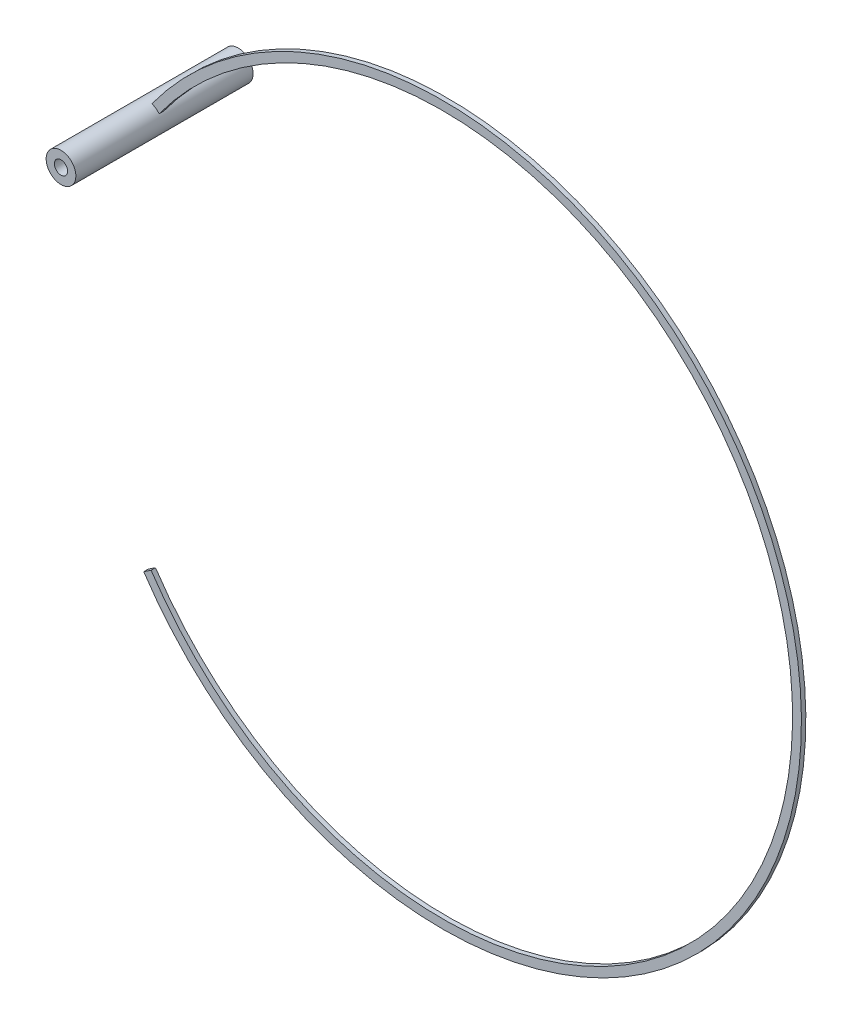
ISO-10303-21;
HEADER;
FILE_DESCRIPTION(('STEP AP214'),'2;1');
FILE_NAME('part.step','',(''),(''),'','','');
FILE_SCHEMA(('AUTOMOTIVE_DESIGN { 1 0 10303 214 1 1 1 1 }'));
ENDSEC;
DATA;
#1=APPLICATION_CONTEXT('core data for automotive mechanical design processes');
#2=APPLICATION_PROTOCOL_DEFINITION('international standard','automotive_design',2000,#1);
#3=PRODUCT_CONTEXT('',#1,'mechanical');
#4=PRODUCT('Part','Part','',(#3));
#5=PRODUCT_RELATED_PRODUCT_CATEGORY('part','',(#4));
#6=PRODUCT_DEFINITION_FORMATION('','',#4);
#7=PRODUCT_DEFINITION_CONTEXT('part definition',#1,'design');
#8=PRODUCT_DEFINITION('design','',#6,#7);
#9=PRODUCT_DEFINITION_SHAPE('','',#8);
#10=(LENGTH_UNIT() NAMED_UNIT(*) SI_UNIT(.MILLI.,.METRE.));
#11=(NAMED_UNIT(*) PLANE_ANGLE_UNIT() SI_UNIT($,.RADIAN.));
#12=(NAMED_UNIT(*) SI_UNIT($,.STERADIAN.) SOLID_ANGLE_UNIT());
#13=UNCERTAINTY_MEASURE_WITH_UNIT(LENGTH_MEASURE(1.E-05),#10,'distance_accuracy_value','');
#14=(GEOMETRIC_REPRESENTATION_CONTEXT(3) GLOBAL_UNCERTAINTY_ASSIGNED_CONTEXT((#13)) GLOBAL_UNIT_ASSIGNED_CONTEXT((#10,
#11,#12)) REPRESENTATION_CONTEXT('',''));
#15=CARTESIAN_POINT('',(0.,0.,0.));
#16=DIRECTION('',(0.,0.,1.));
#17=DIRECTION('',(1.,0.,0.));
#18=AXIS2_PLACEMENT_3D('',#15,#16,#17);
#19=CARTESIAN_POINT('',(-12.4954171005917,27.3397937105227,10.));
#20=DIRECTION('',(0.,0.,-1.));
#21=DIRECTION('',(-1.,0.,0.));
#22=AXIS2_PLACEMENT_3D('',#19,#20,#21);
#23=CYLINDRICAL_SURFACE('',#22,1.67526348251068);
#24=CARTESIAN_POINT('',(-12.4954171005917,27.3397937105227,-10.));
#25=DIRECTION('',(0.,0.,1.));
#26=DIRECTION('',(1.,0.,0.));
#27=AXIS2_PLACEMENT_3D('',#24,#25,#26);
#28=CIRCLE('',#27,1.67526348251068);
#29=CARTESIAN_POINT('',(-10.8201536180811,27.3397937105227,-10.));
#30=VERTEX_POINT('',#29);
#31=EDGE_CURVE('E159',#30,#30,#28,.T.);
#32=ORIENTED_EDGE('',*,*,#31,.T.);
#33=EDGE_LOOP('',(#32));
#34=FACE_BOUND('',#33,.T.);
#35=CARTESIAN_POINT('',(-12.4954171005917,27.3397937105227,10.));
#36=DIRECTION('',(0.,0.,1.));
#37=DIRECTION('',(1.,0.,0.));
#38=AXIS2_PLACEMENT_3D('',#35,#36,#37);
#39=CIRCLE('',#38,1.67526348251068);
#40=CARTESIAN_POINT('',(-10.8201536180811,27.3397937105227,10.));
#41=VERTEX_POINT('',#40);
#42=EDGE_CURVE('E162',#41,#41,#39,.T.);
#43=ORIENTED_EDGE('',*,*,#42,.F.);
#44=EDGE_LOOP('',(#43));
#45=FACE_BOUND('',#44,.T.);
#46=CARTESIAN_POINT('',(-12.4954171005917,27.3397937105227,0.248562421087051));
#47=DIRECTION('',(0.,0.,-1.));
#48=DIRECTION('',(-1.,0.,0.));
#49=AXIS2_PLACEMENT_3D('',#46,#47,#48);
#50=CIRCLE('',#49,1.67526348251068);
#51=CARTESIAN_POINT('',(-11.9941859035628,28.9383164732505,0.248562421087051));
#52=VERTEX_POINT('',#51);
#53=CARTESIAN_POINT('',(-11.1726537818172,28.367803894489,0.248562421087051));
#54=VERTEX_POINT('',#53);
#55=EDGE_CURVE('E48',#52,#54,#50,.T.);
#56=ORIENTED_EDGE('',*,*,#55,.F.);
#57=DIRECTION('',(0.,0.,1.));
#58=VECTOR('',#57,1.);
#59=CARTESIAN_POINT('',(-11.9941859035628,28.9383164732505,0.));
#60=LINE('',#59,#58);
#61=CARTESIAN_POINT('',(-11.9941859035627,28.9383164732506,-0.248562421087051));
#62=VERTEX_POINT('',#61);
#63=EDGE_CURVE('E52',#62,#52,#60,.T.);
#64=ORIENTED_EDGE('',*,*,#63,.F.);
#65=CARTESIAN_POINT('',(-12.4954171005917,27.3397937105227,-0.248562421087051));
#66=DIRECTION('',(0.,0.,1.));
#67=DIRECTION('',(1.,0.,0.));
#68=AXIS2_PLACEMENT_3D('',#65,#66,#67);
#69=CIRCLE('',#68,1.67526348251068);
#70=CARTESIAN_POINT('',(-11.1726537818172,28.367803894489,-0.248562421087051));
#71=VERTEX_POINT('',#70);
#72=EDGE_CURVE('E151',#71,#62,#69,.T.);
#73=ORIENTED_EDGE('',*,*,#72,.F.);
#74=DIRECTION('',(0.,0.,1.));
#75=VECTOR('',#74,1.);
#76=CARTESIAN_POINT('',(-11.1726537818172,28.367803894489,0.));
#77=LINE('',#76,#75);
#78=EDGE_CURVE('E148',#54,#71,#77,.F.);
#79=ORIENTED_EDGE('',*,*,#78,.F.);
#80=EDGE_LOOP('',(#56,#64,#73,#79));
#81=FACE_BOUND('',#80,.T.);
#82=ADVANCED_FACE('F34',(#34,#45,#81),#23,.T.);
#83=CARTESIAN_POINT('',(-12.4954171005917,27.3397937105227,10.));
#84=DIRECTION('',(0.,0.,-1.));
#85=DIRECTION('',(-1.,0.,0.));
#86=AXIS2_PLACEMENT_3D('',#83,#84,#85);
#87=CYLINDRICAL_SURFACE('',#86,0.75);
#88=CARTESIAN_POINT('',(-12.4954171005917,27.3397937105227,-10.));
#89=DIRECTION('',(0.,0.,1.));
#90=DIRECTION('',(1.,0.,0.));
#91=AXIS2_PLACEMENT_3D('',#88,#89,#90);
#92=CIRCLE('',#91,0.75);
#93=CARTESIAN_POINT('',(-11.7454171005917,27.3397937105227,-10.));
#94=VERTEX_POINT('',#93);
#95=EDGE_CURVE('E155',#94,#94,#92,.T.);
#96=ORIENTED_EDGE('',*,*,#95,.F.);
#97=EDGE_LOOP('',(#96));
#98=FACE_BOUND('',#97,.T.);
#99=CARTESIAN_POINT('',(-12.4954171005917,27.3397937105227,10.));
#100=DIRECTION('',(0.,0.,1.));
#101=DIRECTION('',(1.,0.,0.));
#102=AXIS2_PLACEMENT_3D('',#99,#100,#101);
#103=CIRCLE('',#102,0.75);
#104=CARTESIAN_POINT('',(-11.7454171005917,27.3397937105227,10.));
#105=VERTEX_POINT('',#104);
#106=EDGE_CURVE('E156',#105,#105,#103,.T.);
#107=ORIENTED_EDGE('',*,*,#106,.T.);
#108=EDGE_LOOP('',(#107));
#109=FACE_BOUND('',#108,.T.);
#110=DIRECTION('',(0.,0.,1.));
#111=VECTOR('',#110,1.);
#112=CARTESIAN_POINT('',(-12.5969235654751,28.082892921656,0.));
#113=LINE('',#112,#111);
#114=CARTESIAN_POINT('',(-12.5969235654752,28.0828929216559,-0.248562421087051));
#115=VERTEX_POINT('',#114);
#116=CARTESIAN_POINT('',(-12.5969235654751,28.082892921656,0.248562421087051));
#117=VERTEX_POINT('',#116);
#118=EDGE_CURVE('E41',#115,#117,#113,.T.);
#119=ORIENTED_EDGE('',*,*,#118,.T.);
#120=CARTESIAN_POINT('',(-12.4954171005917,27.3397937105227,0.248562421087051));
#121=DIRECTION('',(0.,0.,-1.));
#122=DIRECTION('',(-1.,0.,0.));
#123=AXIS2_PLACEMENT_3D('',#120,#121,#122);
#124=CIRCLE('',#123,0.75);
#125=CARTESIAN_POINT('',(-11.7681896517025,27.5232064624842,0.248562421087051));
#126=VERTEX_POINT('',#125);
#127=EDGE_CURVE('E11',#117,#126,#124,.T.);
#128=ORIENTED_EDGE('',*,*,#127,.T.);
#129=DIRECTION('',(0.,0.,1.));
#130=VECTOR('',#129,1.);
#131=CARTESIAN_POINT('',(-11.7681896517025,27.5232064624842,0.));
#132=LINE('',#131,#130);
#133=CARTESIAN_POINT('',(-11.7681896517025,27.5232064624842,-0.248562421087051));
#134=VERTEX_POINT('',#133);
#135=EDGE_CURVE('E102',#126,#134,#132,.F.);
#136=ORIENTED_EDGE('',*,*,#135,.T.);
#137=CARTESIAN_POINT('',(-12.4954171005917,27.3397937105227,-0.248562421087051));
#138=DIRECTION('',(0.,0.,1.));
#139=DIRECTION('',(1.,0.,0.));
#140=AXIS2_PLACEMENT_3D('',#137,#138,#139);
#141=CIRCLE('',#140,0.75);
#142=EDGE_CURVE('E168',#134,#115,#141,.T.);
#143=ORIENTED_EDGE('',*,*,#142,.T.);
#144=EDGE_LOOP('',(#119,#128,#136,#143));
#145=FACE_BOUND('',#144,.T.);
#146=ADVANCED_FACE('F172',(#98,#109,#145),#87,.F.);
#147=CARTESIAN_POINT('',(-12.4954171005917,27.3397937105227,10.));
#148=DIRECTION('',(0.,0.,1.));
#149=DIRECTION('',(1.,0.,0.));
#150=AXIS2_PLACEMENT_3D('',#147,#148,#149);
#151=PLANE('',#150);
#152=ORIENTED_EDGE('',*,*,#42,.T.);
#153=EDGE_LOOP('',(#152));
#154=FACE_BOUND('',#153,.T.);
#155=ORIENTED_EDGE('',*,*,#106,.F.);
#156=EDGE_LOOP('',(#155));
#157=FACE_BOUND('',#156,.T.);
#158=ADVANCED_FACE('F197',(#154,#157),#151,.T.);
#159=CARTESIAN_POINT('',(-12.4954171005917,27.3397937105227,-10.));
#160=DIRECTION('',(0.,0.,1.));
#161=DIRECTION('',(1.,0.,0.));
#162=AXIS2_PLACEMENT_3D('',#159,#160,#161);
#163=PLANE('',#162);
#164=ORIENTED_EDGE('',*,*,#31,.F.);
#165=EDGE_LOOP('',(#164));
#166=FACE_BOUND('',#165,.T.);
#167=ORIENTED_EDGE('',*,*,#95,.T.);
#168=EDGE_LOOP('',(#167));
#169=FACE_BOUND('',#168,.T.);
#170=ADVANCED_FACE('F206',(#166,#169),#163,.F.);
#171=CARTESIAN_POINT('',(8.77461110150517,13.1904654816144,0.));
#172=DIRECTION('',(-0.553868203666457,-0.832604355601922,0.));
#173=DIRECTION('',(0.832604355601922,-0.553868203666457,0.));
#174=AXIS2_PLACEMENT_3D('',#171,#172,#173);
#175=PLANE('',#174);
#176=DIRECTION('',(0.832604355601922,-0.553868203666457,0.));
#177=VECTOR('',#176,1.);
#178=CARTESIAN_POINT('',(-12.9117192783927,27.616727812356,0.248562421087051));
#179=LINE('',#178,#177);
#180=CARTESIAN_POINT('',(-12.9117192783927,27.616727812356,0.248562421087051));
#181=VERTEX_POINT('',#180);
#182=CARTESIAN_POINT('',(-12.0791149227908,27.0628596086895,0.248562421087051));
#183=VERTEX_POINT('',#182);
#184=EDGE_CURVE('E112',#181,#183,#179,.T.);
#185=ORIENTED_EDGE('',*,*,#184,.F.);
#186=DIRECTION('',(0.,0.,1.));
#187=VECTOR('',#186,1.);
#188=CARTESIAN_POINT('',(-12.9117192783927,27.616727812356,-0.248562421087051));
#189=LINE('',#188,#187);
#190=CARTESIAN_POINT('',(-12.9117192783927,27.616727812356,-0.248562421087051));
#191=VERTEX_POINT('',#190);
#192=EDGE_CURVE('E123',#191,#181,#189,.T.);
#193=ORIENTED_EDGE('',*,*,#192,.F.);
#194=DIRECTION('',(-0.832604355601922,0.553868203666457,0.));
#195=VECTOR('',#194,1.);
#196=CARTESIAN_POINT('',(-12.9117192783927,27.616727812356,-0.248562421087051));
#197=LINE('',#196,#195);
#198=CARTESIAN_POINT('',(-12.0791149227908,27.0628596086895,-0.248562421087051));
#199=VERTEX_POINT('',#198);
#200=EDGE_CURVE('E114',#199,#191,#197,.T.);
#201=ORIENTED_EDGE('',*,*,#200,.F.);
#202=DIRECTION('',(0.,0.,-1.));
#203=VECTOR('',#202,1.);
#204=CARTESIAN_POINT('',(-12.0791149227908,27.0628596086895,-0.248562421087051));
#205=LINE('',#204,#203);
#206=EDGE_CURVE('E99',#183,#199,#205,.T.);
#207=ORIENTED_EDGE('',*,*,#206,.F.);
#208=EDGE_LOOP('',(#185,#193,#201,#207));
#209=FACE_BOUND('',#208,.T.);
#210=ADVANCED_FACE('F110',(#209),#175,.T.);
#211=CARTESIAN_POINT('',(20.8087571234852,5.18506556386456,0.));
#212=DIRECTION('',(0.,0.,1.));
#213=DIRECTION('',(1.,0.,0.));
#214=AXIS2_PLACEMENT_3D('',#211,#212,#213);
#215=CYLINDRICAL_SURFACE('',#214,39.5);
#216=ORIENTED_EDGE('',*,*,#135,.F.);
#217=CARTESIAN_POINT('',(20.8087571234852,5.18506556386456,0.248562421087051));
#218=DIRECTION('',(0.,0.,1.));
#219=DIRECTION('',(1.,0.,0.));
#220=AXIS2_PLACEMENT_3D('',#217,#218,#219);
#221=CIRCLE('',#220,39.5);
#222=EDGE_CURVE('E96',#126,#183,#221,.T.);
#223=ORIENTED_EDGE('',*,*,#222,.T.);
#224=ORIENTED_EDGE('',*,*,#206,.T.);
#225=CARTESIAN_POINT('',(20.8087571234852,5.18506556386456,-0.248562421087051));
#226=DIRECTION('',(0.,0.,1.));
#227=DIRECTION('',(1.,0.,0.));
#228=AXIS2_PLACEMENT_3D('',#225,#226,#227);
#229=CIRCLE('',#228,39.5);
#230=EDGE_CURVE('E137',#134,#199,#229,.T.);
#231=ORIENTED_EDGE('',*,*,#230,.F.);
#232=EDGE_LOOP('',(#216,#223,#224,#231));
#233=FACE_BOUND('',#232,.T.);
#234=ADVANCED_FACE('F98',(#233),#215,.F.);
#235=CARTESIAN_POINT('',(-12.911719278393,-17.2465966846264,-0.248562421087051));
#236=DIRECTION('',(0.,0.,1.));
#237=DIRECTION('',(1.,0.,0.));
#238=AXIS2_PLACEMENT_3D('',#235,#236,#237);
#239=PLANE('',#238);
#240=ORIENTED_EDGE('',*,*,#142,.F.);
#241=ORIENTED_EDGE('',*,*,#230,.T.);
#242=ORIENTED_EDGE('',*,*,#200,.T.);
#243=CARTESIAN_POINT('',(20.8087571234852,5.18506556386456,-0.248562421087051));
#244=DIRECTION('',(0.,0.,1.));
#245=DIRECTION('',(1.,0.,0.));
#246=AXIS2_PLACEMENT_3D('',#243,#244,#245);
#247=CIRCLE('',#246,40.5);
#248=EDGE_CURVE('E141',#115,#191,#247,.T.);
#249=ORIENTED_EDGE('',*,*,#248,.F.);
#250=EDGE_LOOP('',(#240,#241,#242,#249));
#251=FACE_BOUND('',#250,.T.);
#252=ADVANCED_FACE('F178',(#251),#239,.F.);
#253=CARTESIAN_POINT('',(20.8087571234852,5.18506556386456,0.));
#254=DIRECTION('',(0.,0.,1.));
#255=DIRECTION('',(1.,0.,0.));
#256=AXIS2_PLACEMENT_3D('',#253,#254,#255);
#257=CYLINDRICAL_SURFACE('',#256,40.5);
#258=ORIENTED_EDGE('',*,*,#118,.F.);
#259=ORIENTED_EDGE('',*,*,#248,.T.);
#260=ORIENTED_EDGE('',*,*,#192,.T.);
#261=CARTESIAN_POINT('',(20.8087571234852,5.18506556386456,0.248562421087051));
#262=DIRECTION('',(0.,0.,1.));
#263=DIRECTION('',(1.,0.,0.));
#264=AXIS2_PLACEMENT_3D('',#261,#262,#263);
#265=CIRCLE('',#264,40.5);
#266=EDGE_CURVE('E118',#117,#181,#265,.T.);
#267=ORIENTED_EDGE('',*,*,#266,.F.);
#268=EDGE_LOOP('',(#258,#259,#260,#267));
#269=FACE_BOUND('',#268,.T.);
#270=ADVANCED_FACE('F176',(#269),#257,.T.);
#271=CARTESIAN_POINT('',(-12.911719278393,-17.2465966846264,0.248562421087051));
#272=DIRECTION('',(0.,0.,-1.));
#273=DIRECTION('',(-1.,0.,0.));
#274=AXIS2_PLACEMENT_3D('',#271,#272,#273);
#275=PLANE('',#274);
#276=ORIENTED_EDGE('',*,*,#127,.F.);
#277=ORIENTED_EDGE('',*,*,#266,.T.);
#278=ORIENTED_EDGE('',*,*,#184,.T.);
#279=ORIENTED_EDGE('',*,*,#222,.F.);
#280=EDGE_LOOP('',(#276,#277,#278,#279));
#281=FACE_BOUND('',#280,.T.);
#282=ADVANCED_FACE('F116',(#281),#275,.F.);
#283=CARTESIAN_POINT('',(-12.911719278393,-17.2465966846264,0.248562421087051));
#284=VERTEX_POINT('',#283);
#285=EDGE_CURVE('E145',#284,#52,#265,.T.);
#286=ORIENTED_EDGE('',*,*,#285,.T.);
#287=ORIENTED_EDGE('',*,*,#55,.T.);
#288=CARTESIAN_POINT('',(-12.0791149227911,-16.69272848096,0.248562421087051));
#289=VERTEX_POINT('',#288);
#290=EDGE_CURVE('E105',#289,#54,#221,.T.);
#291=ORIENTED_EDGE('',*,*,#290,.F.);
#292=DIRECTION('',(0.832604355601933,0.553868203666441,0.));
#293=VECTOR('',#292,1.);
#294=CARTESIAN_POINT('',(-12.911719278393,-17.2465966846264,0.248562421087051));
#295=LINE('',#294,#293);
#296=EDGE_CURVE('E125',#284,#289,#295,.T.);
#297=ORIENTED_EDGE('',*,*,#296,.F.);
#298=EDGE_LOOP('',(#286,#287,#291,#297));
#299=FACE_BOUND('',#298,.T.);
#300=ADVANCED_FACE('F228',(#299),#275,.F.);
#301=CARTESIAN_POINT('',(-12.911719278393,-17.2465966846264,-0.248562421087051));
#302=VERTEX_POINT('',#301);
#303=EDGE_CURVE('E142',#302,#62,#247,.T.);
#304=ORIENTED_EDGE('',*,*,#303,.T.);
#305=ORIENTED_EDGE('',*,*,#63,.T.);
#306=ORIENTED_EDGE('',*,*,#285,.F.);
#307=DIRECTION('',(0.,0.,1.));
#308=VECTOR('',#307,1.);
#309=CARTESIAN_POINT('',(-12.911719278393,-17.2465966846264,-0.248562421087051));
#310=LINE('',#309,#308);
#311=EDGE_CURVE('E106',#302,#284,#310,.T.);
#312=ORIENTED_EDGE('',*,*,#311,.F.);
#313=EDGE_LOOP('',(#304,#305,#306,#312));
#314=FACE_BOUND('',#313,.T.);
#315=ADVANCED_FACE('F187',(#314),#257,.T.);
#316=CARTESIAN_POINT('',(-12.0791149227911,-16.69272848096,-0.248562421087051));
#317=VERTEX_POINT('',#316);
#318=EDGE_CURVE('E138',#317,#71,#229,.T.);
#319=ORIENTED_EDGE('',*,*,#318,.T.);
#320=ORIENTED_EDGE('',*,*,#72,.T.);
#321=ORIENTED_EDGE('',*,*,#303,.F.);
#322=DIRECTION('',(-0.832604355601933,-0.553868203666441,0.));
#323=VECTOR('',#322,1.);
#324=CARTESIAN_POINT('',(-12.911719278393,-17.2465966846264,-0.248562421087051));
#325=LINE('',#324,#323);
#326=EDGE_CURVE('E131',#317,#302,#325,.T.);
#327=ORIENTED_EDGE('',*,*,#326,.F.);
#328=EDGE_LOOP('',(#319,#320,#321,#327));
#329=FACE_BOUND('',#328,.T.);
#330=ADVANCED_FACE('F181',(#329),#239,.F.);
#331=ORIENTED_EDGE('',*,*,#290,.T.);
#332=ORIENTED_EDGE('',*,*,#78,.T.);
#333=ORIENTED_EDGE('',*,*,#318,.F.);
#334=DIRECTION('',(0.,0.,-1.));
#335=VECTOR('',#334,1.);
#336=CARTESIAN_POINT('',(-12.0791149227911,-16.69272848096,-0.248562421087051));
#337=LINE('',#336,#335);
#338=EDGE_CURVE('E128',#289,#317,#337,.T.);
#339=ORIENTED_EDGE('',*,*,#338,.F.);
#340=EDGE_LOOP('',(#331,#332,#333,#339));
#341=FACE_BOUND('',#340,.T.);
#342=ADVANCED_FACE('F189',(#341),#215,.F.);
#343=CARTESIAN_POINT('',(8.77461110150514,-2.82033435388526,0.));
#344=DIRECTION('',(0.553868203666441,-0.832604355601933,0.));
#345=DIRECTION('',(0.832604355601933,0.553868203666441,0.));
#346=AXIS2_PLACEMENT_3D('',#343,#344,#345);
#347=PLANE('',#346);
#348=ORIENTED_EDGE('',*,*,#296,.T.);
#349=ORIENTED_EDGE('',*,*,#338,.T.);
#350=ORIENTED_EDGE('',*,*,#326,.T.);
#351=ORIENTED_EDGE('',*,*,#311,.T.);
#352=EDGE_LOOP('',(#348,#349,#350,#351));
#353=FACE_BOUND('',#352,.T.);
#354=ADVANCED_FACE('F223',(#353),#347,.F.);
#355=CLOSED_SHELL('',(#82,#146,#158,#170,#210,#234,#252,#270,#282,#300,#315,#330,#342,#354));
#356=MANIFOLD_SOLID_BREP('B2',#355);
#357=ADVANCED_BREP_SHAPE_REPRESENTATION('',(#18,#356),#14);
#358=SHAPE_DEFINITION_REPRESENTATION(#9,#357);
ENDSEC;
END-ISO-10303-21;
